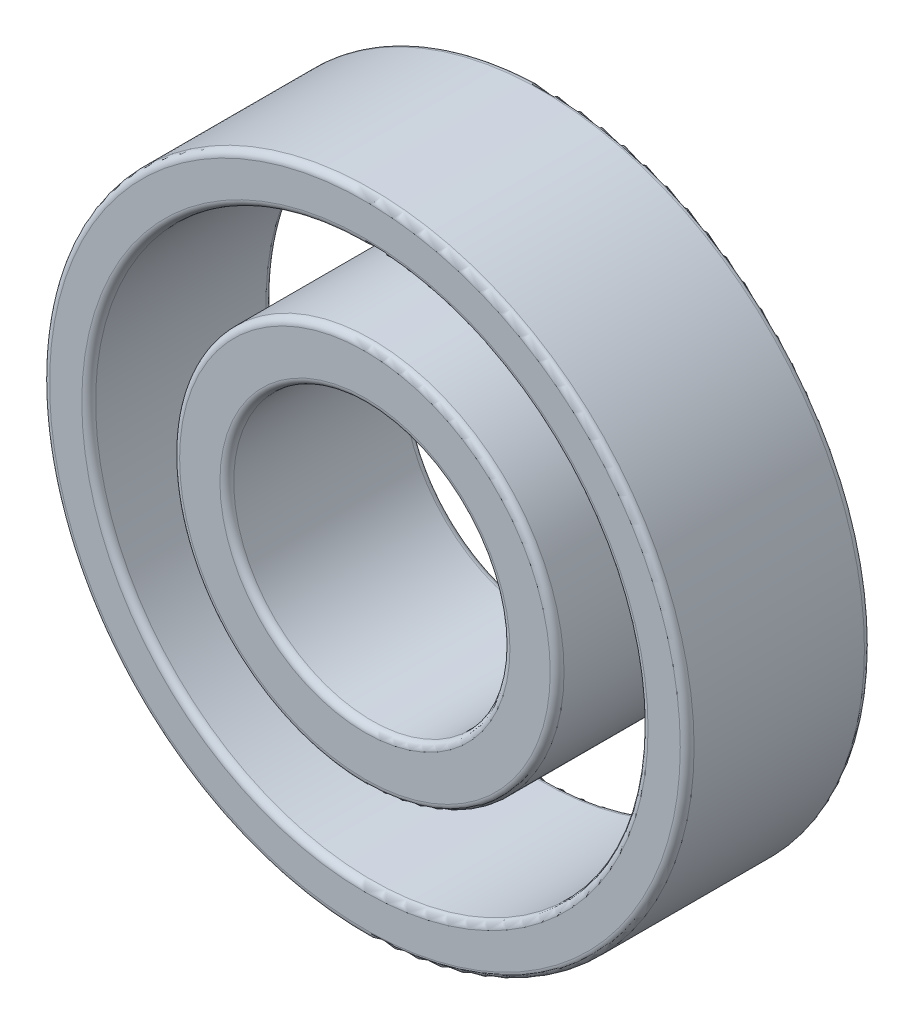
ISO-10303-21;
HEADER;
FILE_DESCRIPTION(('STEP AP214'),'2;1');
FILE_NAME('part.step','',(''),(''),'','','');
FILE_SCHEMA(('AUTOMOTIVE_DESIGN { 1 0 10303 214 1 1 1 1 }'));
ENDSEC;
DATA;
#1=APPLICATION_CONTEXT('core data for automotive mechanical design processes');
#2=APPLICATION_PROTOCOL_DEFINITION('international standard','automotive_design',2000,#1);
#3=PRODUCT_CONTEXT('',#1,'mechanical');
#4=PRODUCT('Part','Part','',(#3));
#5=PRODUCT_RELATED_PRODUCT_CATEGORY('part','',(#4));
#6=PRODUCT_DEFINITION_FORMATION('','',#4);
#7=PRODUCT_DEFINITION_CONTEXT('part definition',#1,'design');
#8=PRODUCT_DEFINITION('design','',#6,#7);
#9=PRODUCT_DEFINITION_SHAPE('','',#8);
#10=(LENGTH_UNIT() NAMED_UNIT(*) SI_UNIT(.MILLI.,.METRE.));
#11=(NAMED_UNIT(*) PLANE_ANGLE_UNIT() SI_UNIT($,.RADIAN.));
#12=(NAMED_UNIT(*) SI_UNIT($,.STERADIAN.) SOLID_ANGLE_UNIT());
#13=UNCERTAINTY_MEASURE_WITH_UNIT(LENGTH_MEASURE(1.E-05),#10,'distance_accuracy_value','');
#14=(GEOMETRIC_REPRESENTATION_CONTEXT(3) GLOBAL_UNCERTAINTY_ASSIGNED_CONTEXT((#13)) GLOBAL_UNIT_ASSIGNED_CONTEXT((#10,
#11,#12)) REPRESENTATION_CONTEXT('',''));
#15=CARTESIAN_POINT('',(0.,0.,0.));
#16=DIRECTION('',(0.,0.,1.));
#17=DIRECTION('',(1.,0.,0.));
#18=AXIS2_PLACEMENT_3D('',#15,#16,#17);
#19=CARTESIAN_POINT('',(0.,0.,8.));
#20=DIRECTION('',(0.,0.,1.));
#21=DIRECTION('',(1.,0.,0.));
#22=AXIS2_PLACEMENT_3D('',#19,#20,#21);
#23=PLANE('',#22);
#24=CARTESIAN_POINT('',(0.,0.,8.));
#25=DIRECTION('',(0.,0.,1.));
#26=DIRECTION('',(1.,0.,0.));
#27=AXIS2_PLACEMENT_3D('',#24,#25,#26);
#28=CIRCLE('',#27,6.3);
#29=CARTESIAN_POINT('',(6.3,0.,8.));
#30=VERTEX_POINT('',#29);
#31=EDGE_CURVE('E97',#30,#30,#28,.F.);
#32=ORIENTED_EDGE('',*,*,#31,.T.);
#33=EDGE_LOOP('',(#32));
#34=FACE_BOUND('',#33,.T.);
#35=CARTESIAN_POINT('',(0.,0.,8.));
#36=DIRECTION('',(0.,0.,1.));
#37=DIRECTION('',(1.,0.,0.));
#38=AXIS2_PLACEMENT_3D('',#35,#36,#37);
#39=CIRCLE('',#38,8.05);
#40=CARTESIAN_POINT('',(8.05,0.,8.));
#41=VERTEX_POINT('',#40);
#42=EDGE_CURVE('E100',#41,#41,#39,.T.);
#43=ORIENTED_EDGE('',*,*,#42,.T.);
#44=EDGE_LOOP('',(#43));
#45=FACE_BOUND('',#44,.T.);
#46=ADVANCED_FACE('F77',(#34,#45),#23,.T.);
#47=CARTESIAN_POINT('',(0.,0.,0.));
#48=DIRECTION('',(0.,0.,1.));
#49=DIRECTION('',(1.,0.,0.));
#50=AXIS2_PLACEMENT_3D('',#47,#48,#49);
#51=PLANE('',#50);
#52=CARTESIAN_POINT('',(0.,0.,0.));
#53=DIRECTION('',(0.,0.,1.));
#54=DIRECTION('',(1.,0.,0.));
#55=AXIS2_PLACEMENT_3D('',#52,#53,#54);
#56=CIRCLE('',#55,6.3);
#57=CARTESIAN_POINT('',(6.3,0.,0.));
#58=VERTEX_POINT('',#57);
#59=EDGE_CURVE('E12',#58,#58,#56,.T.);
#60=ORIENTED_EDGE('',*,*,#59,.T.);
#61=EDGE_LOOP('',(#60));
#62=FACE_BOUND('',#61,.T.);
#63=CARTESIAN_POINT('',(0.,0.,0.));
#64=DIRECTION('',(0.,0.,1.));
#65=DIRECTION('',(1.,0.,0.));
#66=AXIS2_PLACEMENT_3D('',#63,#64,#65);
#67=CIRCLE('',#66,8.05);
#68=CARTESIAN_POINT('',(8.05,0.,0.));
#69=VERTEX_POINT('',#68);
#70=EDGE_CURVE('E84',#69,#69,#67,.F.);
#71=ORIENTED_EDGE('',*,*,#70,.T.);
#72=EDGE_LOOP('',(#71));
#73=FACE_BOUND('',#72,.T.);
#74=ADVANCED_FACE('F125',(#62,#73),#51,.F.);
#75=CARTESIAN_POINT('',(0.,0.,8.));
#76=DIRECTION('',(0.,0.,-1.));
#77=DIRECTION('',(-1.,0.,0.));
#78=AXIS2_PLACEMENT_3D('',#75,#76,#77);
#79=CYLINDRICAL_SURFACE('',#78,8.35);
#80=CARTESIAN_POINT('',(0.,0.,7.7));
#81=DIRECTION('',(0.,0.,1.));
#82=DIRECTION('',(1.,0.,0.));
#83=AXIS2_PLACEMENT_3D('',#80,#81,#82);
#84=CIRCLE('',#83,8.35);
#85=CARTESIAN_POINT('',(8.35,0.,7.7));
#86=VERTEX_POINT('',#85);
#87=EDGE_CURVE('E88',#86,#86,#84,.F.);
#88=ORIENTED_EDGE('',*,*,#87,.T.);
#89=EDGE_LOOP('',(#88));
#90=FACE_BOUND('',#89,.T.);
#91=CARTESIAN_POINT('',(0.,0.,0.3));
#92=DIRECTION('',(0.,0.,1.));
#93=DIRECTION('',(1.,0.,0.));
#94=AXIS2_PLACEMENT_3D('',#91,#92,#93);
#95=CIRCLE('',#94,8.35);
#96=CARTESIAN_POINT('',(8.35,0.,0.3));
#97=VERTEX_POINT('',#96);
#98=EDGE_CURVE('E92',#97,#97,#95,.T.);
#99=ORIENTED_EDGE('',*,*,#98,.T.);
#100=EDGE_LOOP('',(#99));
#101=FACE_BOUND('',#100,.T.);
#102=ADVANCED_FACE('F131',(#90,#101),#79,.T.);
#103=CARTESIAN_POINT('',(0.,0.,8.));
#104=DIRECTION('',(0.,0.,-1.));
#105=DIRECTION('',(-1.,0.,0.));
#106=AXIS2_PLACEMENT_3D('',#103,#104,#105);
#107=CYLINDRICAL_SURFACE('',#106,6.);
#108=CARTESIAN_POINT('',(0.,0.,7.7));
#109=DIRECTION('',(0.,0.,1.));
#110=DIRECTION('',(1.,0.,0.));
#111=AXIS2_PLACEMENT_3D('',#108,#109,#110);
#112=CIRCLE('',#111,6.);
#113=CARTESIAN_POINT('',(6.,0.,7.7));
#114=VERTEX_POINT('',#113);
#115=EDGE_CURVE('E103',#114,#114,#112,.T.);
#116=ORIENTED_EDGE('',*,*,#115,.T.);
#117=EDGE_LOOP('',(#116));
#118=FACE_BOUND('',#117,.T.);
#119=CARTESIAN_POINT('',(0.,0.,0.3));
#120=DIRECTION('',(0.,0.,1.));
#121=DIRECTION('',(1.,0.,0.));
#122=AXIS2_PLACEMENT_3D('',#119,#120,#121);
#123=CIRCLE('',#122,6.);
#124=CARTESIAN_POINT('',(6.,0.,0.3));
#125=VERTEX_POINT('',#124);
#126=EDGE_CURVE('E106',#125,#125,#123,.F.);
#127=ORIENTED_EDGE('',*,*,#126,.T.);
#128=EDGE_LOOP('',(#127));
#129=FACE_BOUND('',#128,.T.);
#130=ADVANCED_FACE('F110',(#118,#129),#107,.F.);
#131=CARTESIAN_POINT('',(0.,0.,7.7));
#132=DIRECTION('',(0.,0.,1.));
#133=DIRECTION('',(1.,0.,0.));
#134=AXIS2_PLACEMENT_3D('',#131,#132,#133);
#135=TOROIDAL_SURFACE('',#134,6.3,0.3);
#136=ORIENTED_EDGE('',*,*,#31,.F.);
#137=EDGE_LOOP('',(#136));
#138=FACE_BOUND('',#137,.T.);
#139=ORIENTED_EDGE('',*,*,#115,.F.);
#140=EDGE_LOOP('',(#139));
#141=FACE_BOUND('',#140,.T.);
#142=ADVANCED_FACE('F121',(#138,#141),#135,.T.);
#143=CARTESIAN_POINT('',(0.,0.,7.7));
#144=DIRECTION('',(0.,0.,1.));
#145=DIRECTION('',(1.,0.,0.));
#146=AXIS2_PLACEMENT_3D('',#143,#144,#145);
#147=TOROIDAL_SURFACE('',#146,8.05,0.3);
#148=ORIENTED_EDGE('',*,*,#87,.F.);
#149=EDGE_LOOP('',(#148));
#150=FACE_BOUND('',#149,.T.);
#151=ORIENTED_EDGE('',*,*,#42,.F.);
#152=EDGE_LOOP('',(#151));
#153=FACE_BOUND('',#152,.T.);
#154=ADVANCED_FACE('F115',(#150,#153),#147,.T.);
#155=CARTESIAN_POINT('',(0.,0.,0.3));
#156=DIRECTION('',(0.,0.,1.));
#157=DIRECTION('',(1.,0.,0.));
#158=AXIS2_PLACEMENT_3D('',#155,#156,#157);
#159=TOROIDAL_SURFACE('',#158,6.3,0.3);
#160=ORIENTED_EDGE('',*,*,#126,.F.);
#161=EDGE_LOOP('',(#160));
#162=FACE_BOUND('',#161,.T.);
#163=ORIENTED_EDGE('',*,*,#59,.F.);
#164=EDGE_LOOP('',(#163));
#165=FACE_BOUND('',#164,.T.);
#166=ADVANCED_FACE('F112',(#162,#165),#159,.T.);
#167=CARTESIAN_POINT('',(0.,0.,0.3));
#168=DIRECTION('',(0.,0.,1.));
#169=DIRECTION('',(1.,0.,0.));
#170=AXIS2_PLACEMENT_3D('',#167,#168,#169);
#171=TOROIDAL_SURFACE('',#170,8.05,0.3);
#172=ORIENTED_EDGE('',*,*,#70,.F.);
#173=EDGE_LOOP('',(#172));
#174=FACE_BOUND('',#173,.T.);
#175=ORIENTED_EDGE('',*,*,#98,.F.);
#176=EDGE_LOOP('',(#175));
#177=FACE_BOUND('',#176,.T.);
#178=ADVANCED_FACE('F79',(#174,#177),#171,.T.);
#179=CLOSED_SHELL('',(#46,#74,#102,#130,#142,#154,#166,#178));
#180=MANIFOLD_SOLID_BREP('B2',#179);
#181=CARTESIAN_POINT('',(0.,0.,8.));
#182=DIRECTION('',(0.,0.,1.));
#183=DIRECTION('',(1.,0.,0.));
#184=AXIS2_PLACEMENT_3D('',#181,#182,#183);
#185=PLANE('',#184);
#186=CARTESIAN_POINT('',(0.,0.,8.));
#187=DIRECTION('',(0.,0.,1.));
#188=DIRECTION('',(1.,0.,0.));
#189=AXIS2_PLACEMENT_3D('',#186,#187,#188);
#190=CIRCLE('',#189,12.3);
#191=CARTESIAN_POINT('',(12.3,0.,8.));
#192=VERTEX_POINT('',#191);
#193=EDGE_CURVE('E76',#192,#192,#190,.F.);
#194=ORIENTED_EDGE('',*,*,#193,.T.);
#195=EDGE_LOOP('',(#194));
#196=FACE_BOUND('',#195,.T.);
#197=CARTESIAN_POINT('',(0.,0.,8.));
#198=DIRECTION('',(0.,0.,1.));
#199=DIRECTION('',(1.,0.,0.));
#200=AXIS2_PLACEMENT_3D('',#197,#198,#199);
#201=CIRCLE('',#200,13.7);
#202=CARTESIAN_POINT('',(13.7,0.,8.));
#203=VERTEX_POINT('',#202);
#204=EDGE_CURVE('E206',#203,#203,#201,.T.);
#205=ORIENTED_EDGE('',*,*,#204,.T.);
#206=EDGE_LOOP('',(#205));
#207=FACE_BOUND('',#206,.T.);
#208=ADVANCED_FACE('F199',(#196,#207),#185,.T.);
#209=CARTESIAN_POINT('',(0.,0.,0.));
#210=DIRECTION('',(0.,0.,1.));
#211=DIRECTION('',(1.,0.,0.));
#212=AXIS2_PLACEMENT_3D('',#209,#210,#211);
#213=PLANE('',#212);
#214=CARTESIAN_POINT('',(0.,0.,0.));
#215=DIRECTION('',(0.,0.,1.));
#216=DIRECTION('',(1.,0.,0.));
#217=AXIS2_PLACEMENT_3D('',#214,#215,#216);
#218=CIRCLE('',#217,12.3);
#219=CARTESIAN_POINT('',(12.3,0.,0.));
#220=VERTEX_POINT('',#219);
#221=EDGE_CURVE('E225',#220,#220,#218,.T.);
#222=ORIENTED_EDGE('',*,*,#221,.T.);
#223=EDGE_LOOP('',(#222));
#224=FACE_BOUND('',#223,.T.);
#225=CARTESIAN_POINT('',(0.,0.,0.));
#226=DIRECTION('',(0.,0.,1.));
#227=DIRECTION('',(1.,0.,0.));
#228=AXIS2_PLACEMENT_3D('',#225,#226,#227);
#229=CIRCLE('',#228,13.7);
#230=CARTESIAN_POINT('',(13.7,0.,0.));
#231=VERTEX_POINT('',#230);
#232=EDGE_CURVE('E228',#231,#231,#229,.F.);
#233=ORIENTED_EDGE('',*,*,#232,.T.);
#234=EDGE_LOOP('',(#233));
#235=FACE_BOUND('',#234,.T.);
#236=ADVANCED_FACE('F232',(#224,#235),#213,.F.);
#237=CARTESIAN_POINT('',(0.,0.,8.));
#238=DIRECTION('',(0.,0.,-1.));
#239=DIRECTION('',(-1.,0.,0.));
#240=AXIS2_PLACEMENT_3D('',#237,#238,#239);
#241=CYLINDRICAL_SURFACE('',#240,14.);
#242=CARTESIAN_POINT('',(0.,0.,0.3));
#243=DIRECTION('',(0.,0.,1.));
#244=DIRECTION('',(1.,0.,0.));
#245=AXIS2_PLACEMENT_3D('',#242,#243,#244);
#246=CIRCLE('',#245,14.);
#247=CARTESIAN_POINT('',(14.,0.,0.3));
#248=VERTEX_POINT('',#247);
#249=EDGE_CURVE('E210',#248,#248,#246,.T.);
#250=ORIENTED_EDGE('',*,*,#249,.T.);
#251=EDGE_LOOP('',(#250));
#252=FACE_BOUND('',#251,.T.);
#253=CARTESIAN_POINT('',(0.,0.,7.7));
#254=DIRECTION('',(0.,0.,1.));
#255=DIRECTION('',(1.,0.,0.));
#256=AXIS2_PLACEMENT_3D('',#253,#254,#255);
#257=CIRCLE('',#256,14.);
#258=CARTESIAN_POINT('',(14.,0.,7.7));
#259=VERTEX_POINT('',#258);
#260=EDGE_CURVE('E214',#259,#259,#257,.F.);
#261=ORIENTED_EDGE('',*,*,#260,.T.);
#262=EDGE_LOOP('',(#261));
#263=FACE_BOUND('',#262,.T.);
#264=ADVANCED_FACE('F242',(#252,#263),#241,.T.);
#265=CARTESIAN_POINT('',(0.,0.,8.));
#266=DIRECTION('',(0.,0.,-1.));
#267=DIRECTION('',(-1.,0.,0.));
#268=AXIS2_PLACEMENT_3D('',#265,#266,#267);
#269=CYLINDRICAL_SURFACE('',#268,12.);
#270=CARTESIAN_POINT('',(0.,0.,0.3));
#271=DIRECTION('',(0.,0.,1.));
#272=DIRECTION('',(1.,0.,0.));
#273=AXIS2_PLACEMENT_3D('',#270,#271,#272);
#274=CIRCLE('',#273,12.);
#275=CARTESIAN_POINT('',(12.,0.,0.3));
#276=VERTEX_POINT('',#275);
#277=EDGE_CURVE('E219',#276,#276,#274,.F.);
#278=ORIENTED_EDGE('',*,*,#277,.T.);
#279=EDGE_LOOP('',(#278));
#280=FACE_BOUND('',#279,.T.);
#281=CARTESIAN_POINT('',(0.,0.,7.7));
#282=DIRECTION('',(0.,0.,1.));
#283=DIRECTION('',(1.,0.,0.));
#284=AXIS2_PLACEMENT_3D('',#281,#282,#283);
#285=CIRCLE('',#284,12.);
#286=CARTESIAN_POINT('',(12.,0.,7.7));
#287=VERTEX_POINT('',#286);
#288=EDGE_CURVE('E222',#287,#287,#285,.T.);
#289=ORIENTED_EDGE('',*,*,#288,.T.);
#290=EDGE_LOOP('',(#289));
#291=FACE_BOUND('',#290,.T.);
#292=ADVANCED_FACE('F245',(#280,#291),#269,.F.);
#293=CARTESIAN_POINT('',(0.,0.,0.3));
#294=DIRECTION('',(0.,0.,1.));
#295=DIRECTION('',(1.,0.,0.));
#296=AXIS2_PLACEMENT_3D('',#293,#294,#295);
#297=TOROIDAL_SURFACE('',#296,12.3,0.3);
#298=ORIENTED_EDGE('',*,*,#277,.F.);
#299=EDGE_LOOP('',(#298));
#300=FACE_BOUND('',#299,.T.);
#301=ORIENTED_EDGE('',*,*,#221,.F.);
#302=EDGE_LOOP('',(#301));
#303=FACE_BOUND('',#302,.T.);
#304=ADVANCED_FACE('F238',(#300,#303),#297,.T.);
#305=CARTESIAN_POINT('',(0.,0.,0.3));
#306=DIRECTION('',(0.,0.,1.));
#307=DIRECTION('',(1.,0.,0.));
#308=AXIS2_PLACEMENT_3D('',#305,#306,#307);
#309=TOROIDAL_SURFACE('',#308,13.7,0.3);
#310=ORIENTED_EDGE('',*,*,#232,.F.);
#311=EDGE_LOOP('',(#310));
#312=FACE_BOUND('',#311,.T.);
#313=ORIENTED_EDGE('',*,*,#249,.F.);
#314=EDGE_LOOP('',(#313));
#315=FACE_BOUND('',#314,.T.);
#316=ADVANCED_FACE('F234',(#312,#315),#309,.T.);
#317=CARTESIAN_POINT('',(0.,0.,7.7));
#318=DIRECTION('',(0.,0.,1.));
#319=DIRECTION('',(1.,0.,0.));
#320=AXIS2_PLACEMENT_3D('',#317,#318,#319);
#321=TOROIDAL_SURFACE('',#320,12.3,0.3);
#322=ORIENTED_EDGE('',*,*,#193,.F.);
#323=EDGE_LOOP('',(#322));
#324=FACE_BOUND('',#323,.T.);
#325=ORIENTED_EDGE('',*,*,#288,.F.);
#326=EDGE_LOOP('',(#325));
#327=FACE_BOUND('',#326,.T.);
#328=ADVANCED_FACE('F237',(#324,#327),#321,.T.);
#329=CARTESIAN_POINT('',(0.,0.,7.7));
#330=DIRECTION('',(0.,0.,1.));
#331=DIRECTION('',(1.,0.,0.));
#332=AXIS2_PLACEMENT_3D('',#329,#330,#331);
#333=TOROIDAL_SURFACE('',#332,13.7,0.3);
#334=ORIENTED_EDGE('',*,*,#260,.F.);
#335=EDGE_LOOP('',(#334));
#336=FACE_BOUND('',#335,.T.);
#337=ORIENTED_EDGE('',*,*,#204,.F.);
#338=EDGE_LOOP('',(#337));
#339=FACE_BOUND('',#338,.T.);
#340=ADVANCED_FACE('F201',(#336,#339),#333,.T.);
#341=CLOSED_SHELL('',(#208,#236,#264,#292,#304,#316,#328,#340));
#342=MANIFOLD_SOLID_BREP('B7',#341);
#343=ADVANCED_BREP_SHAPE_REPRESENTATION('',(#18,#180,#342),#14);
#344=SHAPE_DEFINITION_REPRESENTATION(#9,#343);
ENDSEC;
END-ISO-10303-21;
